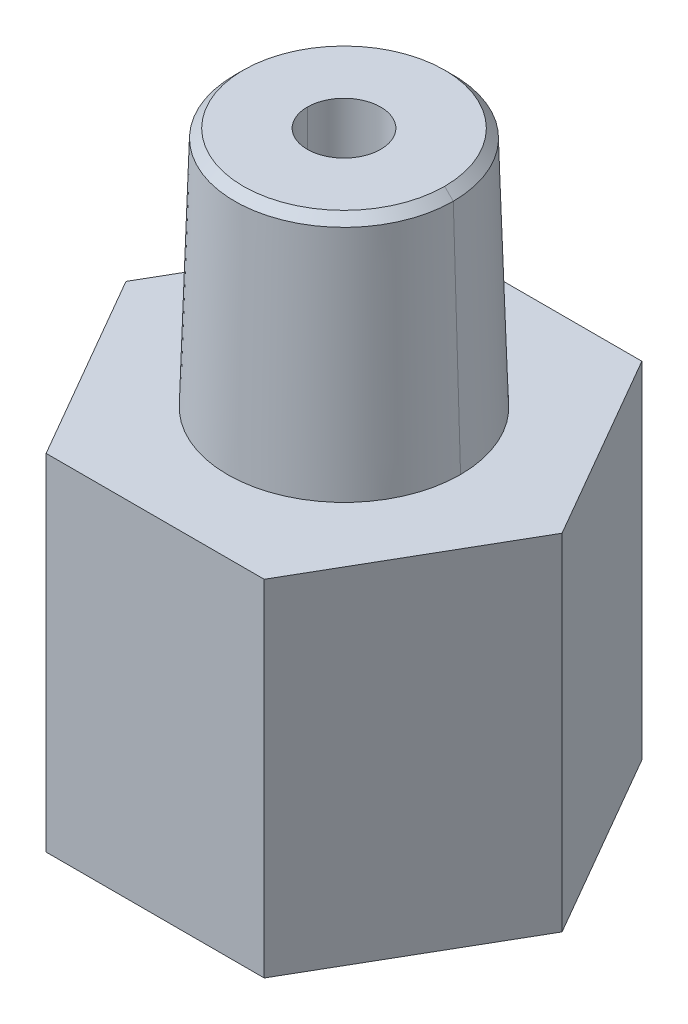
ISO-10303-21;
HEADER;
FILE_DESCRIPTION(('STEP AP214'),'2;1');
FILE_NAME('part.step','',(''),(''),'','','');
FILE_SCHEMA(('AUTOMOTIVE_DESIGN { 1 0 10303 214 1 1 1 1 }'));
ENDSEC;
DATA;
#1=APPLICATION_CONTEXT('core data for automotive mechanical design processes');
#2=APPLICATION_PROTOCOL_DEFINITION('international standard','automotive_design',2000,#1);
#3=PRODUCT_CONTEXT('',#1,'mechanical');
#4=PRODUCT('Part','Part','',(#3));
#5=PRODUCT_RELATED_PRODUCT_CATEGORY('part','',(#4));
#6=PRODUCT_DEFINITION_FORMATION('','',#4);
#7=PRODUCT_DEFINITION_CONTEXT('part definition',#1,'design');
#8=PRODUCT_DEFINITION('design','',#6,#7);
#9=PRODUCT_DEFINITION_SHAPE('','',#8);
#10=(LENGTH_UNIT() NAMED_UNIT(*) SI_UNIT(.MILLI.,.METRE.));
#11=(NAMED_UNIT(*) PLANE_ANGLE_UNIT() SI_UNIT($,.RADIAN.));
#12=(NAMED_UNIT(*) SI_UNIT($,.STERADIAN.) SOLID_ANGLE_UNIT());
#13=UNCERTAINTY_MEASURE_WITH_UNIT(LENGTH_MEASURE(1.E-05),#10,'distance_accuracy_value','');
#14=(GEOMETRIC_REPRESENTATION_CONTEXT(3) GLOBAL_UNCERTAINTY_ASSIGNED_CONTEXT((#13)) GLOBAL_UNIT_ASSIGNED_CONTEXT((#10,
#11,#12)) REPRESENTATION_CONTEXT('',''));
#15=CARTESIAN_POINT('',(0.,0.,0.));
#16=DIRECTION('',(0.,0.,1.));
#17=DIRECTION('',(1.,0.,0.));
#18=AXIS2_PLACEMENT_3D('',#15,#16,#17);
#19=CARTESIAN_POINT('',(0.,20.3200000000834,0.));
#20=DIRECTION('',(0.,-1.,0.));
#21=DIRECTION('',(0.,0.,-1.));
#22=AXIS2_PLACEMENT_3D('',#19,#20,#21);
#23=CONICAL_SURFACE('',#22,6.85799999999759,0.0310668606855386);
#24=DIRECTION('',(-0.0310618635640815,0.999517463895417,0.));
#25=VECTOR('',#24,1.);
#26=CARTESIAN_POINT('',(15514.842257858,-499000.,-1.90002019103619E-12));
#27=LINE('',#26,#25);
#28=CARTESIAN_POINT('',(6.85799999999936,20.3200000000265,0.));
#29=VERTEX_POINT('',#28);
#30=CARTESIAN_POINT('',(6.43174979823558,34.0360000000572,0.));
#31=VERTEX_POINT('',#30);
#32=EDGE_CURVE('E229',#29,#31,#27,.T.);
#33=ORIENTED_EDGE('',*,*,#32,.F.);
#34=CARTESIAN_POINT('',(0.,20.3200000000265,0.));
#35=DIRECTION('',(0.,-1.,0.));
#36=DIRECTION('',(0.,0.,-1.));
#37=AXIS2_PLACEMENT_3D('',#34,#35,#36);
#38=CIRCLE('',#37,6.85799999999935);
#39=CARTESIAN_POINT('',(-6.85799999999936,20.3200000000265,0.));
#40=VERTEX_POINT('',#39);
#41=EDGE_CURVE('E20',#40,#29,#38,.T.);
#42=ORIENTED_EDGE('',*,*,#41,.F.);
#43=DIRECTION('',(0.0310618635640815,0.999517463895417,0.));
#44=VECTOR('',#43,1.);
#45=CARTESIAN_POINT('',(-15514.842257858,-499000.,0.));
#46=LINE('',#45,#44);
#47=CARTESIAN_POINT('',(-6.43174979823513,34.0360000000715,0.));
#48=VERTEX_POINT('',#47);
#49=EDGE_CURVE('E75',#48,#40,#46,.F.);
#50=ORIENTED_EDGE('',*,*,#49,.F.);
#51=CARTESIAN_POINT('',(0.,34.0360000000146,0.));
#52=DIRECTION('',(0.,-1.,0.));
#53=DIRECTION('',(-1.,0.,0.));
#54=AXIS2_PLACEMENT_3D('',#51,#52,#53);
#55=CIRCLE('',#54,6.43174979825289);
#56=EDGE_CURVE('E87',#31,#48,#55,.F.);
#57=ORIENTED_EDGE('',*,*,#56,.F.);
#58=EDGE_LOOP('',(#33,#42,#50,#57));
#59=FACE_BOUND('',#58,.T.);
#60=ADVANCED_FACE('F17',(#59),#23,.T.);
#61=CARTESIAN_POINT('',(0.,20.3200000000834,0.));
#62=DIRECTION('',(0.,-1.,0.));
#63=DIRECTION('',(0.,0.,-1.));
#64=AXIS2_PLACEMENT_3D('',#61,#62,#63);
#65=CONICAL_SURFACE('',#64,6.85799999999759,0.0310668606855386);
#66=ORIENTED_EDGE('',*,*,#49,.T.);
#67=CARTESIAN_POINT('',(0.,20.3200000000265,0.));
#68=DIRECTION('',(0.,-1.,0.));
#69=DIRECTION('',(0.,0.,-1.));
#70=AXIS2_PLACEMENT_3D('',#67,#68,#69);
#71=CIRCLE('',#70,6.85799999999935);
#72=EDGE_CURVE('E232',#29,#40,#71,.T.);
#73=ORIENTED_EDGE('',*,*,#72,.F.);
#74=ORIENTED_EDGE('',*,*,#32,.T.);
#75=CARTESIAN_POINT('',(0.,34.0360000000146,0.));
#76=DIRECTION('',(0.,-1.,0.));
#77=DIRECTION('',(-1.,0.,0.));
#78=AXIS2_PLACEMENT_3D('',#75,#76,#77);
#79=CIRCLE('',#78,6.43174979825289);
#80=EDGE_CURVE('E262',#48,#31,#79,.F.);
#81=ORIENTED_EDGE('',*,*,#80,.F.);
#82=EDGE_LOOP('',(#66,#73,#74,#81));
#83=FACE_BOUND('',#82,.T.);
#84=ADVANCED_FACE('F221',(#83),#65,.T.);
#85=CARTESIAN_POINT('',(0.,20.32,0.));
#86=DIRECTION('',(0.,1.,0.));
#87=DIRECTION('',(0.,0.,1.));
#88=AXIS2_PLACEMENT_3D('',#85,#86,#87);
#89=PLANE('',#88);
#90=ORIENTED_EDGE('',*,*,#41,.T.);
#91=ORIENTED_EDGE('',*,*,#72,.T.);
#92=EDGE_LOOP('',(#90,#91));
#93=FACE_BOUND('',#92,.T.);
#94=DIRECTION('',(0.500000000000017,0.,0.866025403784429));
#95=VECTOR('',#94,1.);
#96=CARTESIAN_POINT('',(-12.8316097327389,20.32,0.));
#97=LINE('',#96,#95);
#98=CARTESIAN_POINT('',(-6.41580486637035,20.32,11.1124999999998));
#99=VERTEX_POINT('',#98);
#100=CARTESIAN_POINT('',(-12.8316097327392,20.32,-1.99413830629739E-13));
#101=VERTEX_POINT('',#100);
#102=EDGE_CURVE('E288',#99,#101,#97,.F.);
#103=ORIENTED_EDGE('',*,*,#102,.F.);
#104=DIRECTION('',(1.,0.,0.));
#105=VECTOR('',#104,1.);
#106=CARTESIAN_POINT('',(-6.4158048663707,20.32,11.1125));
#107=LINE('',#106,#105);
#108=CARTESIAN_POINT('',(6.4158048663707,20.32,11.1125));
#109=VERTEX_POINT('',#108);
#110=EDGE_CURVE('E267',#109,#99,#107,.F.);
#111=ORIENTED_EDGE('',*,*,#110,.F.);
#112=DIRECTION('',(0.500000000000017,0.,-0.866025403784429));
#113=VECTOR('',#112,1.);
#114=CARTESIAN_POINT('',(6.4158048663707,20.32,11.1125));
#115=LINE('',#114,#113);
#116=CARTESIAN_POINT('',(12.8316097327392,20.32,1.99413830629739E-13));
#117=VERTEX_POINT('',#116);
#118=EDGE_CURVE('E269',#117,#109,#115,.F.);
#119=ORIENTED_EDGE('',*,*,#118,.F.);
#120=DIRECTION('',(-0.500000000000017,0.,-0.866025403784429));
#121=VECTOR('',#120,1.);
#122=CARTESIAN_POINT('',(12.8316097327389,20.32,0.));
#123=LINE('',#122,#121);
#124=CARTESIAN_POINT('',(6.41580486637035,20.32,-11.1124999999998));
#125=VERTEX_POINT('',#124);
#126=EDGE_CURVE('E273',#125,#117,#123,.F.);
#127=ORIENTED_EDGE('',*,*,#126,.F.);
#128=DIRECTION('',(-1.,0.,0.));
#129=VECTOR('',#128,1.);
#130=CARTESIAN_POINT('',(6.4158048663707,20.32,-11.1125));
#131=LINE('',#130,#129);
#132=CARTESIAN_POINT('',(-6.4158048663707,20.32,-11.1125));
#133=VERTEX_POINT('',#132);
#134=EDGE_CURVE('E277',#133,#125,#131,.F.);
#135=ORIENTED_EDGE('',*,*,#134,.F.);
#136=DIRECTION('',(-0.500000000000017,0.,0.866025403784429));
#137=VECTOR('',#136,1.);
#138=CARTESIAN_POINT('',(-6.4158048663707,20.32,-11.1125));
#139=LINE('',#138,#137);
#140=EDGE_CURVE('E281',#101,#133,#139,.F.);
#141=ORIENTED_EDGE('',*,*,#140,.F.);
#142=EDGE_LOOP('',(#103,#111,#119,#127,#135,#141));
#143=FACE_BOUND('',#142,.T.);
#144=ADVANCED_FACE('F219',(#93,#143),#89,.T.);
#145=CARTESIAN_POINT('',(0.,34.0360000001283,0.));
#146=DIRECTION('',(0.,-1.,0.));
#147=DIRECTION('',(0.,0.,-1.));
#148=AXIS2_PLACEMENT_3D('',#145,#146,#147);
#149=CONICAL_SURFACE('',#148,6.43174979819605,0.785398163397448);
#150=CARTESIAN_POINT('',(0.,34.5439999999826,0.));
#151=DIRECTION('',(0.,-1.,0.));
#152=DIRECTION('',(0.,0.,-1.));
#153=AXIS2_PLACEMENT_3D('',#150,#151,#152);
#154=CIRCLE('',#153,5.92374979834176);
#155=CARTESIAN_POINT('',(-5.92374979831334,34.5439999999826,0.));
#156=VERTEX_POINT('',#155);
#157=CARTESIAN_POINT('',(5.92374979831334,34.5439999999826,0.));
#158=VERTEX_POINT('',#157);
#159=EDGE_CURVE('E236',#156,#158,#154,.T.);
#160=ORIENTED_EDGE('',*,*,#159,.T.);
#161=DIRECTION('',(-0.707106781186443,0.707106781186652,0.));
#162=VECTOR('',#161,1.);
#163=CARTESIAN_POINT('',(499000.,-498959.53225035,-6.11098752774529E-11));
#164=LINE('',#163,#162);
#165=EDGE_CURVE('E263',#31,#158,#164,.T.);
#166=ORIENTED_EDGE('',*,*,#165,.F.);
#167=ORIENTED_EDGE('',*,*,#56,.T.);
#168=DIRECTION('',(0.707106781186443,0.707106781186652,0.));
#169=VECTOR('',#168,1.);
#170=CARTESIAN_POINT('',(-499000.,-498959.53225035,0.));
#171=LINE('',#170,#169);
#172=EDGE_CURVE('E233',#156,#48,#171,.F.);
#173=ORIENTED_EDGE('',*,*,#172,.F.);
#174=EDGE_LOOP('',(#160,#166,#167,#173));
#175=FACE_BOUND('',#174,.T.);
#176=ADVANCED_FACE('F215',(#175),#149,.T.);
#177=CARTESIAN_POINT('',(0.,34.0360000001283,0.));
#178=DIRECTION('',(0.,-1.,0.));
#179=DIRECTION('',(0.,0.,-1.));
#180=AXIS2_PLACEMENT_3D('',#177,#178,#179);
#181=CONICAL_SURFACE('',#180,6.43174979819605,0.785398163397448);
#182=ORIENTED_EDGE('',*,*,#80,.T.);
#183=ORIENTED_EDGE('',*,*,#165,.T.);
#184=CARTESIAN_POINT('',(0.,34.5439999999826,0.));
#185=DIRECTION('',(0.,-1.,0.));
#186=DIRECTION('',(0.,0.,-1.));
#187=AXIS2_PLACEMENT_3D('',#184,#185,#186);
#188=CIRCLE('',#187,5.92374979834176);
#189=EDGE_CURVE('E239',#158,#156,#188,.T.);
#190=ORIENTED_EDGE('',*,*,#189,.T.);
#191=ORIENTED_EDGE('',*,*,#172,.T.);
#192=EDGE_LOOP('',(#182,#183,#190,#191));
#193=FACE_BOUND('',#192,.T.);
#194=ADVANCED_FACE('F211',(#193),#181,.T.);
#195=CARTESIAN_POINT('',(-6.4158048663707,0.,11.1125));
#196=DIRECTION('',(0.,0.,1.));
#197=DIRECTION('',(1.,0.,0.));
#198=AXIS2_PLACEMENT_3D('',#195,#196,#197);
#199=PLANE('',#198);
#200=DIRECTION('',(0.,1.,0.));
#201=VECTOR('',#200,1.);
#202=CARTESIAN_POINT('',(-6.41580486636932,0.,11.1124999999992));
#203=LINE('',#202,#201);
#204=CARTESIAN_POINT('',(-6.41580486637035,0.,11.1124999999998));
#205=VERTEX_POINT('',#204);
#206=EDGE_CURVE('E285',#205,#99,#203,.T.);
#207=ORIENTED_EDGE('',*,*,#206,.F.);
#208=DIRECTION('',(1.,0.,0.));
#209=VECTOR('',#208,1.);
#210=CARTESIAN_POINT('',(0.,0.,11.1125));
#211=LINE('',#210,#209);
#212=CARTESIAN_POINT('',(6.4158048663707,0.,11.1125));
#213=VERTEX_POINT('',#212);
#214=EDGE_CURVE('E243',#205,#213,#211,.T.);
#215=ORIENTED_EDGE('',*,*,#214,.T.);
#216=DIRECTION('',(0.,1.,0.));
#217=VECTOR('',#216,1.);
#218=CARTESIAN_POINT('',(6.4158048663707,0.,11.1125));
#219=LINE('',#218,#217);
#220=EDGE_CURVE('E271',#109,#213,#219,.F.);
#221=ORIENTED_EDGE('',*,*,#220,.F.);
#222=ORIENTED_EDGE('',*,*,#110,.T.);
#223=EDGE_LOOP('',(#207,#215,#221,#222));
#224=FACE_BOUND('',#223,.T.);
#225=ADVANCED_FACE('F207',(#224),#199,.T.);
#226=CARTESIAN_POINT('',(6.4158048663707,0.,11.1125));
#227=DIRECTION('',(0.866025403784429,0.,0.500000000000017));
#228=DIRECTION('',(0.500000000000017,0.,-0.866025403784429));
#229=AXIS2_PLACEMENT_3D('',#226,#227,#228);
#230=PLANE('',#229);
#231=ORIENTED_EDGE('',*,*,#220,.T.);
#232=DIRECTION('',(0.499999999999909,0.,-0.866025403784491));
#233=VECTOR('',#232,1.);
#234=CARTESIAN_POINT('',(6.4158048663707,0.,11.1125));
#235=LINE('',#234,#233);
#236=CARTESIAN_POINT('',(12.8316097327396,0.,3.97970932965632E-13));
#237=VERTEX_POINT('',#236);
#238=EDGE_CURVE('E293',#213,#237,#235,.T.);
#239=ORIENTED_EDGE('',*,*,#238,.T.);
#240=DIRECTION('',(0.,1.,0.));
#241=VECTOR('',#240,1.);
#242=CARTESIAN_POINT('',(12.8316097327389,0.,0.));
#243=LINE('',#242,#241);
#244=EDGE_CURVE('E275',#117,#237,#243,.F.);
#245=ORIENTED_EDGE('',*,*,#244,.F.);
#246=ORIENTED_EDGE('',*,*,#118,.T.);
#247=EDGE_LOOP('',(#231,#239,#245,#246));
#248=FACE_BOUND('',#247,.T.);
#249=ADVANCED_FACE('F203',(#248),#230,.T.);
#250=CARTESIAN_POINT('',(12.8316097327389,0.,0.));
#251=DIRECTION('',(0.866025403784429,0.,-0.500000000000017));
#252=DIRECTION('',(-0.500000000000017,0.,-0.866025403784429));
#253=AXIS2_PLACEMENT_3D('',#250,#251,#252);
#254=PLANE('',#253);
#255=ORIENTED_EDGE('',*,*,#244,.T.);
#256=DIRECTION('',(-0.499999999999909,0.,-0.866025403784491));
#257=VECTOR('',#256,1.);
#258=CARTESIAN_POINT('',(12.8316097327389,0.,0.));
#259=LINE('',#258,#257);
#260=CARTESIAN_POINT('',(6.41580486637001,0.,-11.1124999999996));
#261=VERTEX_POINT('',#260);
#262=EDGE_CURVE('E296',#237,#261,#259,.T.);
#263=ORIENTED_EDGE('',*,*,#262,.T.);
#264=DIRECTION('',(0.,1.,0.));
#265=VECTOR('',#264,1.);
#266=CARTESIAN_POINT('',(6.4158048663707,0.,-11.1125));
#267=LINE('',#266,#265);
#268=EDGE_CURVE('E279',#125,#261,#267,.F.);
#269=ORIENTED_EDGE('',*,*,#268,.F.);
#270=ORIENTED_EDGE('',*,*,#126,.T.);
#271=EDGE_LOOP('',(#255,#263,#269,#270));
#272=FACE_BOUND('',#271,.T.);
#273=ADVANCED_FACE('F199',(#272),#254,.T.);
#274=CARTESIAN_POINT('',(6.4158048663707,0.,-11.1125));
#275=DIRECTION('',(0.,0.,-1.));
#276=DIRECTION('',(-1.,0.,0.));
#277=AXIS2_PLACEMENT_3D('',#274,#275,#276);
#278=PLANE('',#277);
#279=ORIENTED_EDGE('',*,*,#268,.T.);
#280=DIRECTION('',(1.,0.,0.));
#281=VECTOR('',#280,1.);
#282=CARTESIAN_POINT('',(0.,0.,-11.1125));
#283=LINE('',#282,#281);
#284=CARTESIAN_POINT('',(-6.4158048663707,0.,-11.1125));
#285=VERTEX_POINT('',#284);
#286=EDGE_CURVE('E299',#261,#285,#283,.F.);
#287=ORIENTED_EDGE('',*,*,#286,.T.);
#288=DIRECTION('',(0.,1.,0.));
#289=VECTOR('',#288,1.);
#290=CARTESIAN_POINT('',(-6.4158048663707,0.,-11.1125));
#291=LINE('',#290,#289);
#292=EDGE_CURVE('E283',#133,#285,#291,.F.);
#293=ORIENTED_EDGE('',*,*,#292,.F.);
#294=ORIENTED_EDGE('',*,*,#134,.T.);
#295=EDGE_LOOP('',(#279,#287,#293,#294));
#296=FACE_BOUND('',#295,.T.);
#297=ADVANCED_FACE('F195',(#296),#278,.T.);
#298=CARTESIAN_POINT('',(-6.4158048663707,0.,-11.1125));
#299=DIRECTION('',(-0.866025403784429,0.,-0.500000000000017));
#300=DIRECTION('',(-0.500000000000017,0.,0.866025403784429));
#301=AXIS2_PLACEMENT_3D('',#298,#299,#300);
#302=PLANE('',#301);
#303=ORIENTED_EDGE('',*,*,#292,.T.);
#304=DIRECTION('',(-0.499999999999909,0.,0.866025403784491));
#305=VECTOR('',#304,1.);
#306=CARTESIAN_POINT('',(-6.4158048663707,0.,-11.1125));
#307=LINE('',#306,#305);
#308=CARTESIAN_POINT('',(-12.8316097327396,0.,-3.97970932965632E-13));
#309=VERTEX_POINT('',#308);
#310=EDGE_CURVE('E302',#285,#309,#307,.T.);
#311=ORIENTED_EDGE('',*,*,#310,.T.);
#312=DIRECTION('',(0.,1.,0.));
#313=VECTOR('',#312,1.);
#314=CARTESIAN_POINT('',(-12.8316097327389,0.,0.));
#315=LINE('',#314,#313);
#316=EDGE_CURVE('E240',#101,#309,#315,.F.);
#317=ORIENTED_EDGE('',*,*,#316,.F.);
#318=ORIENTED_EDGE('',*,*,#140,.T.);
#319=EDGE_LOOP('',(#303,#311,#317,#318));
#320=FACE_BOUND('',#319,.T.);
#321=ADVANCED_FACE('F191',(#320),#302,.T.);
#322=CARTESIAN_POINT('',(-12.8316097327389,0.,0.));
#323=DIRECTION('',(-0.866025403784429,0.,0.500000000000017));
#324=DIRECTION('',(0.500000000000017,0.,0.866025403784429));
#325=AXIS2_PLACEMENT_3D('',#322,#323,#324);
#326=PLANE('',#325);
#327=ORIENTED_EDGE('',*,*,#316,.T.);
#328=DIRECTION('',(0.499999999999909,0.,0.866025403784491));
#329=VECTOR('',#328,1.);
#330=CARTESIAN_POINT('',(-12.8316097327389,0.,0.));
#331=LINE('',#330,#329);
#332=EDGE_CURVE('E247',#309,#205,#331,.T.);
#333=ORIENTED_EDGE('',*,*,#332,.T.);
#334=ORIENTED_EDGE('',*,*,#206,.T.);
#335=ORIENTED_EDGE('',*,*,#102,.T.);
#336=EDGE_LOOP('',(#327,#333,#334,#335));
#337=FACE_BOUND('',#336,.T.);
#338=ADVANCED_FACE('F187',(#337),#326,.T.);
#339=CARTESIAN_POINT('',(0.,34.544,0.));
#340=DIRECTION('',(0.,-1.,0.));
#341=DIRECTION('',(0.,0.,-1.));
#342=AXIS2_PLACEMENT_3D('',#339,#340,#341);
#343=PLANE('',#342);
#344=CARTESIAN_POINT('',(0.,34.544,0.));
#345=DIRECTION('',(0.,-1.,0.));
#346=DIRECTION('',(0.,0.,-1.));
#347=AXIS2_PLACEMENT_3D('',#344,#345,#346);
#348=CIRCLE('',#347,2.159);
#349=CARTESIAN_POINT('',(2.159,34.544,0.));
#350=VERTEX_POINT('',#349);
#351=CARTESIAN_POINT('',(-2.159,34.544,0.));
#352=VERTEX_POINT('',#351);
#353=EDGE_CURVE('E244',#350,#352,#348,.T.);
#354=ORIENTED_EDGE('',*,*,#353,.T.);
#355=CARTESIAN_POINT('',(0.,34.544,0.));
#356=DIRECTION('',(0.,-1.,0.));
#357=DIRECTION('',(0.,0.,-1.));
#358=AXIS2_PLACEMENT_3D('',#355,#356,#357);
#359=CIRCLE('',#358,2.159);
#360=EDGE_CURVE('E248',#352,#350,#359,.T.);
#361=ORIENTED_EDGE('',*,*,#360,.T.);
#362=EDGE_LOOP('',(#354,#361));
#363=FACE_BOUND('',#362,.T.);
#364=ORIENTED_EDGE('',*,*,#159,.F.);
#365=ORIENTED_EDGE('',*,*,#189,.F.);
#366=EDGE_LOOP('',(#364,#365));
#367=FACE_BOUND('',#366,.T.);
#368=ADVANCED_FACE('F183',(#363,#367),#343,.F.);
#369=CARTESIAN_POINT('',(0.,0.,0.));
#370=DIRECTION('',(0.,1.,0.));
#371=DIRECTION('',(0.,0.,1.));
#372=AXIS2_PLACEMENT_3D('',#369,#370,#371);
#373=PLANE('',#372);
#374=CARTESIAN_POINT('',(0.,2.77555756156289E-13,0.));
#375=DIRECTION('',(0.,-1.,0.));
#376=DIRECTION('',(0.,0.,-1.));
#377=AXIS2_PLACEMENT_3D('',#374,#375,#376);
#378=CIRCLE('',#377,7.65220110997794);
#379=CARTESIAN_POINT('',(-7.65220110997794,2.77555756156289E-13,0.));
#380=VERTEX_POINT('',#379);
#381=CARTESIAN_POINT('',(7.65220110997794,2.77555756156289E-13,0.));
#382=VERTEX_POINT('',#381);
#383=EDGE_CURVE('E252',#380,#382,#378,.F.);
#384=ORIENTED_EDGE('',*,*,#383,.T.);
#385=CARTESIAN_POINT('',(0.,2.77555756156289E-13,0.));
#386=DIRECTION('',(0.,-1.,0.));
#387=DIRECTION('',(0.,0.,-1.));
#388=AXIS2_PLACEMENT_3D('',#385,#386,#387);
#389=CIRCLE('',#388,7.65220110997794);
#390=EDGE_CURVE('E136',#382,#380,#389,.F.);
#391=ORIENTED_EDGE('',*,*,#390,.T.);
#392=EDGE_LOOP('',(#384,#391));
#393=FACE_BOUND('',#392,.T.);
#394=ORIENTED_EDGE('',*,*,#310,.F.);
#395=ORIENTED_EDGE('',*,*,#286,.F.);
#396=ORIENTED_EDGE('',*,*,#262,.F.);
#397=ORIENTED_EDGE('',*,*,#238,.F.);
#398=ORIENTED_EDGE('',*,*,#214,.F.);
#399=ORIENTED_EDGE('',*,*,#332,.F.);
#400=EDGE_LOOP('',(#394,#395,#396,#397,#398,#399));
#401=FACE_BOUND('',#400,.T.);
#402=ADVANCED_FACE('F179',(#393,#401),#373,.F.);
#403=CARTESIAN_POINT('',(0.,34.544,0.));
#404=DIRECTION('',(0.,-1.,0.));
#405=DIRECTION('',(0.,0.,-1.));
#406=AXIS2_PLACEMENT_3D('',#403,#404,#405);
#407=CYLINDRICAL_SURFACE('',#406,2.159);
#408=ORIENTED_EDGE('',*,*,#353,.F.);
#409=DIRECTION('',(0.,-1.,0.));
#410=VECTOR('',#409,1.);
#411=CARTESIAN_POINT('',(2.159,34.544,0.));
#412=LINE('',#411,#410);
#413=CARTESIAN_POINT('',(2.159,15.875,0.));
#414=VERTEX_POINT('',#413);
#415=EDGE_CURVE('E251',#350,#414,#412,.T.);
#416=ORIENTED_EDGE('',*,*,#415,.T.);
#417=CARTESIAN_POINT('',(0.,15.875,0.));
#418=DIRECTION('',(0.,-1.,0.));
#419=DIRECTION('',(0.,0.,-1.));
#420=AXIS2_PLACEMENT_3D('',#417,#418,#419);
#421=CIRCLE('',#420,2.159);
#422=CARTESIAN_POINT('',(-2.159,15.875,0.));
#423=VERTEX_POINT('',#422);
#424=EDGE_CURVE('E140',#414,#423,#421,.T.);
#425=ORIENTED_EDGE('',*,*,#424,.T.);
#426=DIRECTION('',(0.,-1.,0.));
#427=VECTOR('',#426,1.);
#428=CARTESIAN_POINT('',(-2.159,34.544,0.));
#429=LINE('',#428,#427);
#430=EDGE_CURVE('E246',#423,#352,#429,.F.);
#431=ORIENTED_EDGE('',*,*,#430,.T.);
#432=EDGE_LOOP('',(#408,#416,#425,#431));
#433=FACE_BOUND('',#432,.T.);
#434=ADVANCED_FACE('F175',(#433),#407,.F.);
#435=CARTESIAN_POINT('',(0.,34.544,0.));
#436=DIRECTION('',(0.,-1.,0.));
#437=DIRECTION('',(0.,0.,-1.));
#438=AXIS2_PLACEMENT_3D('',#435,#436,#437);
#439=CYLINDRICAL_SURFACE('',#438,2.159);
#440=ORIENTED_EDGE('',*,*,#360,.F.);
#441=ORIENTED_EDGE('',*,*,#430,.F.);
#442=CARTESIAN_POINT('',(0.,15.875,0.));
#443=DIRECTION('',(0.,-1.,0.));
#444=DIRECTION('',(0.,0.,-1.));
#445=AXIS2_PLACEMENT_3D('',#442,#443,#444);
#446=CIRCLE('',#445,2.159);
#447=EDGE_CURVE('E153',#423,#414,#446,.T.);
#448=ORIENTED_EDGE('',*,*,#447,.T.);
#449=ORIENTED_EDGE('',*,*,#415,.F.);
#450=EDGE_LOOP('',(#440,#441,#448,#449));
#451=FACE_BOUND('',#450,.T.);
#452=ADVANCED_FACE('F172',(#451),#439,.F.);
#453=CARTESIAN_POINT('',(0.,2.7972416050126E-13,0.));
#454=DIRECTION('',(0.,-1.,0.));
#455=DIRECTION('',(0.,0.,-1.));
#456=AXIS2_PLACEMENT_3D('',#453,#454,#455);
#457=CONICAL_SURFACE('',#456,7.65220110997794,0.20943951023928);
#458=CARTESIAN_POINT('',(0.,2.3622,0.));
#459=DIRECTION('',(0.,1.,0.));
#460=DIRECTION('',(0.,0.,1.));
#461=AXIS2_PLACEMENT_3D('',#458,#459,#460);
#462=CIRCLE('',#461,7.1501);
#463=CARTESIAN_POINT('',(-7.15010000000028,2.36220000000006,0.));
#464=VERTEX_POINT('',#463);
#465=CARTESIAN_POINT('',(7.15010000000028,2.36220000000006,0.));
#466=VERTEX_POINT('',#465);
#467=EDGE_CURVE('E151',#464,#466,#462,.T.);
#468=ORIENTED_EDGE('',*,*,#467,.T.);
#469=DIRECTION('',(-0.207911690817721,0.978147600733814,0.));
#470=VECTOR('',#469,1.);
#471=CARTESIAN_POINT('',(7.40115055498958,1.1811,0.));
#472=LINE('',#471,#470);
#473=EDGE_CURVE('E130',#466,#382,#472,.F.);
#474=ORIENTED_EDGE('',*,*,#473,.T.);
#475=ORIENTED_EDGE('',*,*,#383,.F.);
#476=DIRECTION('',(0.207911690817721,0.978147600733814,0.));
#477=VECTOR('',#476,1.);
#478=CARTESIAN_POINT('',(-7.40115055498958,1.1811,0.));
#479=LINE('',#478,#477);
#480=EDGE_CURVE('E141',#380,#464,#479,.T.);
#481=ORIENTED_EDGE('',*,*,#480,.T.);
#482=EDGE_LOOP('',(#468,#474,#475,#481));
#483=FACE_BOUND('',#482,.T.);
#484=ADVANCED_FACE('F152',(#483),#457,.F.);
#485=CARTESIAN_POINT('',(0.,2.7972416050126E-13,0.));
#486=DIRECTION('',(0.,-1.,0.));
#487=DIRECTION('',(0.,0.,-1.));
#488=AXIS2_PLACEMENT_3D('',#485,#486,#487);
#489=CONICAL_SURFACE('',#488,7.65220110997794,0.20943951023928);
#490=CARTESIAN_POINT('',(0.,2.3622,0.));
#491=DIRECTION('',(0.,1.,0.));
#492=DIRECTION('',(0.,0.,1.));
#493=AXIS2_PLACEMENT_3D('',#490,#491,#492);
#494=CIRCLE('',#493,7.1501);
#495=EDGE_CURVE('E134',#466,#464,#494,.T.);
#496=ORIENTED_EDGE('',*,*,#495,.T.);
#497=ORIENTED_EDGE('',*,*,#480,.F.);
#498=ORIENTED_EDGE('',*,*,#390,.F.);
#499=ORIENTED_EDGE('',*,*,#473,.F.);
#500=EDGE_LOOP('',(#496,#497,#498,#499));
#501=FACE_BOUND('',#500,.T.);
#502=ADVANCED_FACE('F132',(#501),#489,.F.);
#503=CARTESIAN_POINT('',(0.,15.875,0.));
#504=DIRECTION('',(0.,1.,0.));
#505=DIRECTION('',(0.,0.,1.));
#506=AXIS2_PLACEMENT_3D('',#503,#504,#505);
#507=PLANE('',#506);
#508=ORIENTED_EDGE('',*,*,#424,.F.);
#509=ORIENTED_EDGE('',*,*,#447,.F.);
#510=EDGE_LOOP('',(#508,#509));
#511=FACE_BOUND('',#510,.T.);
#512=CARTESIAN_POINT('',(0.,15.875,0.));
#513=DIRECTION('',(0.,1.,0.));
#514=DIRECTION('',(0.,0.,1.));
#515=AXIS2_PLACEMENT_3D('',#512,#513,#514);
#516=CIRCLE('',#515,7.1501);
#517=CARTESIAN_POINT('',(7.1501,15.875,0.));
#518=VERTEX_POINT('',#517);
#519=CARTESIAN_POINT('',(-7.1501,15.875,0.));
#520=VERTEX_POINT('',#519);
#521=EDGE_CURVE('E34',#518,#520,#516,.F.);
#522=ORIENTED_EDGE('',*,*,#521,.T.);
#523=CARTESIAN_POINT('',(0.,15.875,0.));
#524=DIRECTION('',(0.,1.,0.));
#525=DIRECTION('',(0.,0.,1.));
#526=AXIS2_PLACEMENT_3D('',#523,#524,#525);
#527=CIRCLE('',#526,7.1501);
#528=EDGE_CURVE('E26',#520,#518,#527,.F.);
#529=ORIENTED_EDGE('',*,*,#528,.T.);
#530=EDGE_LOOP('',(#522,#529));
#531=FACE_BOUND('',#530,.T.);
#532=ADVANCED_FACE('F157',(#511,#531),#507,.F.);
#533=CARTESIAN_POINT('',(0.,0.,0.));
#534=DIRECTION('',(0.,1.,0.));
#535=DIRECTION('',(0.,0.,1.));
#536=AXIS2_PLACEMENT_3D('',#533,#534,#535);
#537=CYLINDRICAL_SURFACE('',#536,7.1501);
#538=ORIENTED_EDGE('',*,*,#521,.F.);
#539=DIRECTION('',(0.,1.,0.));
#540=VECTOR('',#539,1.);
#541=CARTESIAN_POINT('',(7.1501,0.,0.));
#542=LINE('',#541,#540);
#543=EDGE_CURVE('E11',#518,#466,#542,.F.);
#544=ORIENTED_EDGE('',*,*,#543,.T.);
#545=ORIENTED_EDGE('',*,*,#467,.F.);
#546=DIRECTION('',(0.,1.,0.));
#547=VECTOR('',#546,1.);
#548=CARTESIAN_POINT('',(-7.1501,0.,0.));
#549=LINE('',#548,#547);
#550=EDGE_CURVE('E148',#464,#520,#549,.T.);
#551=ORIENTED_EDGE('',*,*,#550,.T.);
#552=EDGE_LOOP('',(#538,#544,#545,#551));
#553=FACE_BOUND('',#552,.T.);
#554=ADVANCED_FACE('F155',(#553),#537,.F.);
#555=CARTESIAN_POINT('',(0.,0.,0.));
#556=DIRECTION('',(0.,1.,0.));
#557=DIRECTION('',(0.,0.,1.));
#558=AXIS2_PLACEMENT_3D('',#555,#556,#557);
#559=CYLINDRICAL_SURFACE('',#558,7.1501);
#560=ORIENTED_EDGE('',*,*,#528,.F.);
#561=ORIENTED_EDGE('',*,*,#550,.F.);
#562=ORIENTED_EDGE('',*,*,#495,.F.);
#563=ORIENTED_EDGE('',*,*,#543,.F.);
#564=EDGE_LOOP('',(#560,#561,#562,#563));
#565=FACE_BOUND('',#564,.T.);
#566=ADVANCED_FACE('F146',(#565),#559,.F.);
#567=CLOSED_SHELL('',(#60,#84,#144,#176,#194,#225,#249,#273,#297,#321,#338,#368,#402,#434,#452,
#484,#502,#532,#554,#566));
#568=MANIFOLD_SOLID_BREP('B1',#567);
#569=ADVANCED_BREP_SHAPE_REPRESENTATION('',(#18,#568),#14);
#570=SHAPE_DEFINITION_REPRESENTATION(#9,#569);
ENDSEC;
END-ISO-10303-21;
